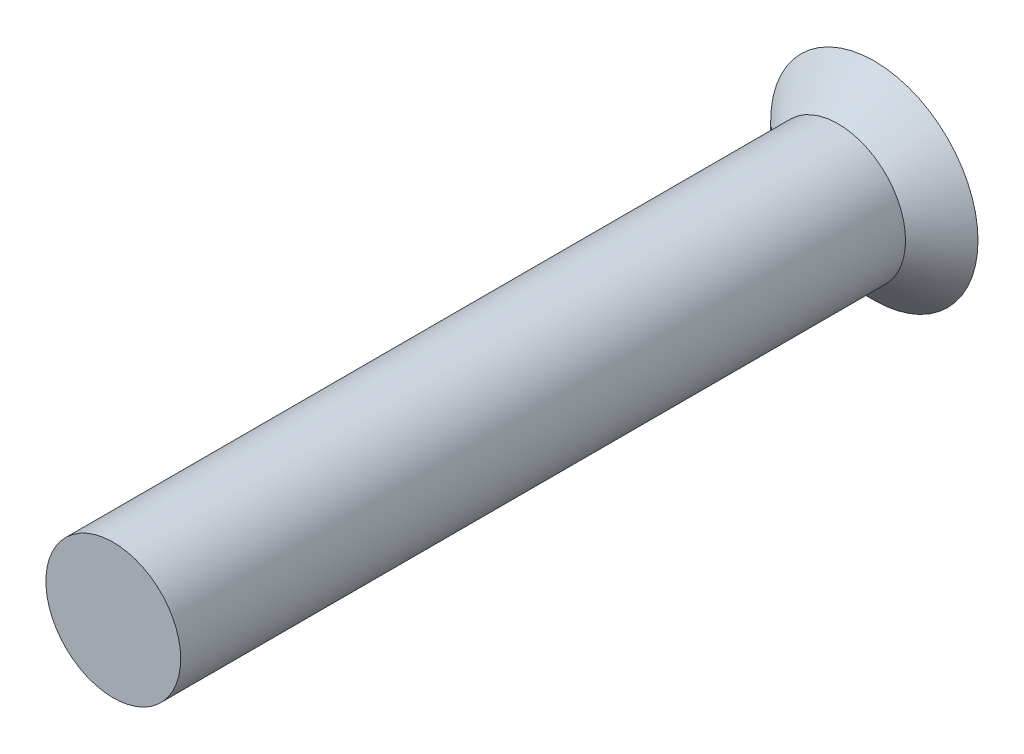
ISO-10303-21;
HEADER;
FILE_DESCRIPTION(('STEP AP214'),'2;1');
FILE_NAME('part.step','',(''),(''),'','','');
FILE_SCHEMA(('AUTOMOTIVE_DESIGN { 1 0 10303 214 1 1 1 1 }'));
ENDSEC;
DATA;
#1=APPLICATION_CONTEXT('core data for automotive mechanical design processes');
#2=APPLICATION_PROTOCOL_DEFINITION('international standard','automotive_design',2000,#1);
#3=PRODUCT_CONTEXT('',#1,'mechanical');
#4=PRODUCT('Part','Part','',(#3));
#5=PRODUCT_RELATED_PRODUCT_CATEGORY('part','',(#4));
#6=PRODUCT_DEFINITION_FORMATION('','',#4);
#7=PRODUCT_DEFINITION_CONTEXT('part definition',#1,'design');
#8=PRODUCT_DEFINITION('design','',#6,#7);
#9=PRODUCT_DEFINITION_SHAPE('','',#8);
#10=(LENGTH_UNIT() NAMED_UNIT(*) SI_UNIT(.MILLI.,.METRE.));
#11=(NAMED_UNIT(*) PLANE_ANGLE_UNIT() SI_UNIT($,.RADIAN.));
#12=(NAMED_UNIT(*) SI_UNIT($,.STERADIAN.) SOLID_ANGLE_UNIT());
#13=UNCERTAINTY_MEASURE_WITH_UNIT(LENGTH_MEASURE(1.E-05),#10,'distance_accuracy_value','');
#14=(GEOMETRIC_REPRESENTATION_CONTEXT(3) GLOBAL_UNCERTAINTY_ASSIGNED_CONTEXT((#13)) GLOBAL_UNIT_ASSIGNED_CONTEXT((#10,
#11,#12)) REPRESENTATION_CONTEXT('',''));
#15=CARTESIAN_POINT('',(0.,0.,0.));
#16=DIRECTION('',(0.,0.,1.));
#17=DIRECTION('',(1.,0.,0.));
#18=AXIS2_PLACEMENT_3D('',#15,#16,#17);
#19=CARTESIAN_POINT('',(0.,0.,2.5));
#20=DIRECTION('',(0.,0.,-1.));
#21=DIRECTION('',(-1.,0.,0.));
#22=AXIS2_PLACEMENT_3D('',#19,#20,#21);
#23=CYLINDRICAL_SURFACE('',#22,0.465);
#24=CARTESIAN_POINT('',(0.,0.,2.5));
#25=DIRECTION('',(0.,0.,1.));
#26=DIRECTION('',(1.,0.,0.));
#27=AXIS2_PLACEMENT_3D('',#24,#25,#26);
#28=CIRCLE('',#27,0.465);
#29=CARTESIAN_POINT('',(0.465,0.,2.5));
#30=VERTEX_POINT('',#29);
#31=EDGE_CURVE('E11',#30,#30,#28,.T.);
#32=ORIENTED_EDGE('',*,*,#31,.F.);
#33=EDGE_LOOP('',(#32));
#34=FACE_BOUND('',#33,.T.);
#35=CARTESIAN_POINT('',(0.,0.,-2.5));
#36=DIRECTION('',(0.,0.,1.));
#37=DIRECTION('',(1.,0.,0.));
#38=AXIS2_PLACEMENT_3D('',#35,#36,#37);
#39=CIRCLE('',#38,0.465);
#40=CARTESIAN_POINT('',(0.465,0.,-2.5));
#41=VERTEX_POINT('',#40);
#42=EDGE_CURVE('E189',#41,#41,#39,.T.);
#43=ORIENTED_EDGE('',*,*,#42,.T.);
#44=EDGE_LOOP('',(#43));
#45=FACE_BOUND('',#44,.T.);
#46=ADVANCED_FACE('F34',(#34,#45),#23,.T.);
#47=CARTESIAN_POINT('',(0.,0.,2.5));
#48=DIRECTION('',(0.,0.,1.));
#49=DIRECTION('',(1.,0.,0.));
#50=AXIS2_PLACEMENT_3D('',#47,#48,#49);
#51=PLANE('',#50);
#52=ORIENTED_EDGE('',*,*,#31,.T.);
#53=EDGE_LOOP('',(#52));
#54=FACE_BOUND('',#53,.T.);
#55=ADVANCED_FACE('F224',(#54),#51,.T.);
#56=CARTESIAN_POINT('',(0.,0.,-2.75));
#57=DIRECTION('',(0.,0.,-1.));
#58=DIRECTION('',(-1.,0.,0.));
#59=AXIS2_PLACEMENT_3D('',#56,#57,#58);
#60=CONICAL_SURFACE('',#59,0.715000000000001,0.785398163397449);
#61=ORIENTED_EDGE('',*,*,#42,.F.);
#62=EDGE_LOOP('',(#61));
#63=FACE_BOUND('',#62,.T.);
#64=CARTESIAN_POINT('',(0.,0.,-2.75));
#65=DIRECTION('',(0.,0.,1.));
#66=DIRECTION('',(1.,0.,0.));
#67=AXIS2_PLACEMENT_3D('',#64,#65,#66);
#68=CIRCLE('',#67,0.715000000000001);
#69=CARTESIAN_POINT('',(0.715000000000001,0.,-2.75));
#70=VERTEX_POINT('',#69);
#71=EDGE_CURVE('E41',#70,#70,#68,.T.);
#72=ORIENTED_EDGE('',*,*,#71,.T.);
#73=EDGE_LOOP('',(#72));
#74=FACE_BOUND('',#73,.T.);
#75=ADVANCED_FACE('F211',(#63,#74),#60,.T.);
#76=CARTESIAN_POINT('',(0.,0.715000000000001,-2.75));
#77=DIRECTION('',(0.,0.,1.));
#78=DIRECTION('',(1.,0.,0.));
#79=AXIS2_PLACEMENT_3D('',#76,#77,#78);
#80=PLANE('',#79);
#81=DIRECTION('',(1.,0.,0.));
#82=VECTOR('',#81,1.);
#83=CARTESIAN_POINT('',(-0.0999999999999999,0.6,-2.75));
#84=LINE('',#83,#82);
#85=CARTESIAN_POINT('',(-0.0999999999999999,0.6,-2.75));
#86=VERTEX_POINT('',#85);
#87=CARTESIAN_POINT('',(0.1,0.6,-2.75));
#88=VERTEX_POINT('',#87);
#89=EDGE_CURVE('E158',#86,#88,#84,.T.);
#90=ORIENTED_EDGE('',*,*,#89,.F.);
#91=DIRECTION('',(0.,1.,0.));
#92=VECTOR('',#91,1.);
#93=CARTESIAN_POINT('',(-0.1,0.1,-2.75));
#94=LINE('',#93,#92);
#95=CARTESIAN_POINT('',(-0.1,0.1,-2.75));
#96=VERTEX_POINT('',#95);
#97=EDGE_CURVE('E48',#96,#86,#94,.T.);
#98=ORIENTED_EDGE('',*,*,#97,.F.);
#99=DIRECTION('',(1.,0.,0.));
#100=VECTOR('',#99,1.);
#101=CARTESIAN_POINT('',(-0.6,0.1,-2.75));
#102=LINE('',#101,#100);
#103=CARTESIAN_POINT('',(-0.6,0.1,-2.75));
#104=VERTEX_POINT('',#103);
#105=EDGE_CURVE('E185',#104,#96,#102,.T.);
#106=ORIENTED_EDGE('',*,*,#105,.F.);
#107=DIRECTION('',(0.,1.,0.));
#108=VECTOR('',#107,1.);
#109=CARTESIAN_POINT('',(-0.6,-0.1,-2.75));
#110=LINE('',#109,#108);
#111=CARTESIAN_POINT('',(-0.6,-0.1,-2.75));
#112=VERTEX_POINT('',#111);
#113=EDGE_CURVE('E183',#112,#104,#110,.T.);
#114=ORIENTED_EDGE('',*,*,#113,.F.);
#115=DIRECTION('',(-1.,0.,0.));
#116=VECTOR('',#115,1.);
#117=CARTESIAN_POINT('',(-0.1,-0.0999999999999998,-2.75));
#118=LINE('',#117,#116);
#119=CARTESIAN_POINT('',(-0.1,-0.0999999999999998,-2.75));
#120=VERTEX_POINT('',#119);
#121=EDGE_CURVE('E132',#120,#112,#118,.T.);
#122=ORIENTED_EDGE('',*,*,#121,.F.);
#123=DIRECTION('',(0.,1.,0.));
#124=VECTOR('',#123,1.);
#125=CARTESIAN_POINT('',(-0.1,-0.6,-2.75));
#126=LINE('',#125,#124);
#127=CARTESIAN_POINT('',(-0.1,-0.6,-2.75));
#128=VERTEX_POINT('',#127);
#129=EDGE_CURVE('E179',#128,#120,#126,.T.);
#130=ORIENTED_EDGE('',*,*,#129,.F.);
#131=DIRECTION('',(-1.,0.,0.));
#132=VECTOR('',#131,1.);
#133=CARTESIAN_POINT('',(0.0999999999999999,-0.6,-2.75));
#134=LINE('',#133,#132);
#135=CARTESIAN_POINT('',(0.0999999999999999,-0.6,-2.75));
#136=VERTEX_POINT('',#135);
#137=EDGE_CURVE('E176',#136,#128,#134,.T.);
#138=ORIENTED_EDGE('',*,*,#137,.F.);
#139=DIRECTION('',(0.,-1.,0.));
#140=VECTOR('',#139,1.);
#141=CARTESIAN_POINT('',(0.1,-0.1,-2.75));
#142=LINE('',#141,#140);
#143=CARTESIAN_POINT('',(0.1,-0.1,-2.75));
#144=VERTEX_POINT('',#143);
#145=EDGE_CURVE('E173',#144,#136,#142,.T.);
#146=ORIENTED_EDGE('',*,*,#145,.F.);
#147=DIRECTION('',(-1.,0.,0.));
#148=VECTOR('',#147,1.);
#149=CARTESIAN_POINT('',(0.6,-0.1,-2.75));
#150=LINE('',#149,#148);
#151=CARTESIAN_POINT('',(0.6,-0.1,-2.75));
#152=VERTEX_POINT('',#151);
#153=EDGE_CURVE('E170',#152,#144,#150,.T.);
#154=ORIENTED_EDGE('',*,*,#153,.F.);
#155=DIRECTION('',(0.,-1.,0.));
#156=VECTOR('',#155,1.);
#157=CARTESIAN_POINT('',(0.6,0.1,-2.75));
#158=LINE('',#157,#156);
#159=CARTESIAN_POINT('',(0.6,0.1,-2.75));
#160=VERTEX_POINT('',#159);
#161=EDGE_CURVE('E167',#160,#152,#158,.T.);
#162=ORIENTED_EDGE('',*,*,#161,.F.);
#163=DIRECTION('',(1.,0.,0.));
#164=VECTOR('',#163,1.);
#165=CARTESIAN_POINT('',(0.0999999999999999,0.1,-2.75));
#166=LINE('',#165,#164);
#167=CARTESIAN_POINT('',(0.0999999999999999,0.1,-2.75));
#168=VERTEX_POINT('',#167);
#169=EDGE_CURVE('E164',#168,#160,#166,.T.);
#170=ORIENTED_EDGE('',*,*,#169,.F.);
#171=DIRECTION('',(0.,-1.,0.));
#172=VECTOR('',#171,1.);
#173=CARTESIAN_POINT('',(0.1,0.6,-2.75));
#174=LINE('',#173,#172);
#175=EDGE_CURVE('E161',#88,#168,#174,.T.);
#176=ORIENTED_EDGE('',*,*,#175,.F.);
#177=EDGE_LOOP('',(#90,#98,#106,#114,#122,#130,#138,#146,#154,#162,#170,#176));
#178=FACE_BOUND('',#177,.T.);
#179=ORIENTED_EDGE('',*,*,#71,.F.);
#180=EDGE_LOOP('',(#179));
#181=FACE_BOUND('',#180,.T.);
#182=ADVANCED_FACE('F213',(#178,#181),#80,.F.);
#183=CARTESIAN_POINT('',(-0.1,0.1,-2.65));
#184=DIRECTION('',(-1.,0.,0.));
#185=DIRECTION('',(0.,-1.,0.));
#186=AXIS2_PLACEMENT_3D('',#183,#184,#185);
#187=PLANE('',#186);
#188=ORIENTED_EDGE('',*,*,#97,.T.);
#189=DIRECTION('',(0.,0.,-1.));
#190=VECTOR('',#189,1.);
#191=CARTESIAN_POINT('',(-0.0999999999999999,0.6,-2.65));
#192=LINE('',#191,#190);
#193=CARTESIAN_POINT('',(-0.0999999999999999,0.6,-2.65));
#194=VERTEX_POINT('',#193);
#195=EDGE_CURVE('E96',#194,#86,#192,.T.);
#196=ORIENTED_EDGE('',*,*,#195,.F.);
#197=DIRECTION('',(0.,1.,0.));
#198=VECTOR('',#197,1.);
#199=CARTESIAN_POINT('',(-0.1,0.1,-2.65));
#200=LINE('',#199,#198);
#201=CARTESIAN_POINT('',(-0.1,0.1,-2.65));
#202=VERTEX_POINT('',#201);
#203=EDGE_CURVE('E187',#202,#194,#200,.T.);
#204=ORIENTED_EDGE('',*,*,#203,.F.);
#205=DIRECTION('',(0.,0.,-1.));
#206=VECTOR('',#205,1.);
#207=CARTESIAN_POINT('',(-0.1,0.1,-2.65));
#208=LINE('',#207,#206);
#209=EDGE_CURVE('E56',#202,#96,#208,.T.);
#210=ORIENTED_EDGE('',*,*,#209,.T.);
#211=EDGE_LOOP('',(#188,#196,#204,#210));
#212=FACE_BOUND('',#211,.T.);
#213=ADVANCED_FACE('F215',(#212),#187,.F.);
#214=CARTESIAN_POINT('',(-0.6,0.1,-2.65));
#215=DIRECTION('',(0.,1.,0.));
#216=DIRECTION('',(-1.,0.,0.));
#217=AXIS2_PLACEMENT_3D('',#214,#215,#216);
#218=PLANE('',#217);
#219=ORIENTED_EDGE('',*,*,#105,.T.);
#220=ORIENTED_EDGE('',*,*,#209,.F.);
#221=DIRECTION('',(1.,0.,0.));
#222=VECTOR('',#221,1.);
#223=CARTESIAN_POINT('',(-0.6,0.1,-2.65));
#224=LINE('',#223,#222);
#225=CARTESIAN_POINT('',(-0.6,0.1,-2.65));
#226=VERTEX_POINT('',#225);
#227=EDGE_CURVE('E144',#226,#202,#224,.T.);
#228=ORIENTED_EDGE('',*,*,#227,.F.);
#229=DIRECTION('',(0.,0.,-1.));
#230=VECTOR('',#229,1.);
#231=CARTESIAN_POINT('',(-0.6,0.1,-2.65));
#232=LINE('',#231,#230);
#233=EDGE_CURVE('E136',#226,#104,#232,.T.);
#234=ORIENTED_EDGE('',*,*,#233,.T.);
#235=EDGE_LOOP('',(#219,#220,#228,#234));
#236=FACE_BOUND('',#235,.T.);
#237=ADVANCED_FACE('F222',(#236),#218,.F.);
#238=CARTESIAN_POINT('',(-0.6,-0.1,-2.65));
#239=DIRECTION('',(-1.,0.,0.));
#240=DIRECTION('',(0.,-1.,0.));
#241=AXIS2_PLACEMENT_3D('',#238,#239,#240);
#242=PLANE('',#241);
#243=ORIENTED_EDGE('',*,*,#113,.T.);
#244=ORIENTED_EDGE('',*,*,#233,.F.);
#245=DIRECTION('',(0.,1.,0.));
#246=VECTOR('',#245,1.);
#247=CARTESIAN_POINT('',(-0.6,-0.1,-2.65));
#248=LINE('',#247,#246);
#249=CARTESIAN_POINT('',(-0.6,-0.1,-2.65));
#250=VERTEX_POINT('',#249);
#251=EDGE_CURVE('E140',#250,#226,#248,.T.);
#252=ORIENTED_EDGE('',*,*,#251,.F.);
#253=DIRECTION('',(0.,0.,-1.));
#254=VECTOR('',#253,1.);
#255=CARTESIAN_POINT('',(-0.6,-0.1,-2.65));
#256=LINE('',#255,#254);
#257=EDGE_CURVE('E125',#250,#112,#256,.T.);
#258=ORIENTED_EDGE('',*,*,#257,.T.);
#259=EDGE_LOOP('',(#243,#244,#252,#258));
#260=FACE_BOUND('',#259,.T.);
#261=ADVANCED_FACE('F141',(#260),#242,.F.);
#262=CARTESIAN_POINT('',(-0.1,-0.0999999999999998,-2.65));
#263=DIRECTION('',(0.,-1.,0.));
#264=DIRECTION('',(1.,0.,0.));
#265=AXIS2_PLACEMENT_3D('',#262,#263,#264);
#266=PLANE('',#265);
#267=ORIENTED_EDGE('',*,*,#121,.T.);
#268=ORIENTED_EDGE('',*,*,#257,.F.);
#269=DIRECTION('',(-1.,0.,0.));
#270=VECTOR('',#269,1.);
#271=CARTESIAN_POINT('',(-0.1,-0.0999999999999998,-2.65));
#272=LINE('',#271,#270);
#273=CARTESIAN_POINT('',(-0.1,-0.0999999999999998,-2.65));
#274=VERTEX_POINT('',#273);
#275=EDGE_CURVE('E129',#274,#250,#272,.T.);
#276=ORIENTED_EDGE('',*,*,#275,.F.);
#277=DIRECTION('',(0.,0.,-1.));
#278=VECTOR('',#277,1.);
#279=CARTESIAN_POINT('',(-0.1,-0.0999999999999998,-2.65));
#280=LINE('',#279,#278);
#281=EDGE_CURVE('E137',#274,#120,#280,.T.);
#282=ORIENTED_EDGE('',*,*,#281,.T.);
#283=EDGE_LOOP('',(#267,#268,#276,#282));
#284=FACE_BOUND('',#283,.T.);
#285=ADVANCED_FACE('F127',(#284),#266,.F.);
#286=CARTESIAN_POINT('',(-0.1,-0.6,-2.65));
#287=DIRECTION('',(-1.,0.,0.));
#288=DIRECTION('',(0.,0.,1.));
#289=AXIS2_PLACEMENT_3D('',#286,#287,#288);
#290=PLANE('',#289);
#291=ORIENTED_EDGE('',*,*,#129,.T.);
#292=ORIENTED_EDGE('',*,*,#281,.F.);
#293=DIRECTION('',(0.,1.,0.));
#294=VECTOR('',#293,1.);
#295=CARTESIAN_POINT('',(-0.1,-0.6,-2.65));
#296=LINE('',#295,#294);
#297=CARTESIAN_POINT('',(-0.1,-0.6,-2.65));
#298=VERTEX_POINT('',#297);
#299=EDGE_CURVE('E150',#298,#274,#296,.T.);
#300=ORIENTED_EDGE('',*,*,#299,.F.);
#301=DIRECTION('',(0.,0.,-1.));
#302=VECTOR('',#301,1.);
#303=CARTESIAN_POINT('',(-0.1,-0.6,-2.65));
#304=LINE('',#303,#302);
#305=EDGE_CURVE('E192',#298,#128,#304,.T.);
#306=ORIENTED_EDGE('',*,*,#305,.T.);
#307=EDGE_LOOP('',(#291,#292,#300,#306));
#308=FACE_BOUND('',#307,.T.);
#309=ADVANCED_FACE('F278',(#308),#290,.F.);
#310=CARTESIAN_POINT('',(0.0999999999999999,-0.6,-2.65));
#311=DIRECTION('',(0.,-1.,0.));
#312=DIRECTION('',(0.,0.,-1.));
#313=AXIS2_PLACEMENT_3D('',#310,#311,#312);
#314=PLANE('',#313);
#315=ORIENTED_EDGE('',*,*,#137,.T.);
#316=ORIENTED_EDGE('',*,*,#305,.F.);
#317=DIRECTION('',(-1.,0.,0.));
#318=VECTOR('',#317,1.);
#319=CARTESIAN_POINT('',(0.0999999999999999,-0.6,-2.65));
#320=LINE('',#319,#318);
#321=CARTESIAN_POINT('',(0.0999999999999999,-0.6,-2.65));
#322=VERTEX_POINT('',#321);
#323=EDGE_CURVE('E152',#322,#298,#320,.T.);
#324=ORIENTED_EDGE('',*,*,#323,.F.);
#325=DIRECTION('',(0.,0.,-1.));
#326=VECTOR('',#325,1.);
#327=CARTESIAN_POINT('',(0.0999999999999999,-0.6,-2.65));
#328=LINE('',#327,#326);
#329=EDGE_CURVE('E194',#322,#136,#328,.T.);
#330=ORIENTED_EDGE('',*,*,#329,.T.);
#331=EDGE_LOOP('',(#315,#316,#324,#330));
#332=FACE_BOUND('',#331,.T.);
#333=ADVANCED_FACE('F287',(#332),#314,.F.);
#334=CARTESIAN_POINT('',(0.1,-0.1,-2.65));
#335=DIRECTION('',(1.,0.,0.));
#336=DIRECTION('',(0.,1.,0.));
#337=AXIS2_PLACEMENT_3D('',#334,#335,#336);
#338=PLANE('',#337);
#339=ORIENTED_EDGE('',*,*,#145,.T.);
#340=ORIENTED_EDGE('',*,*,#329,.F.);
#341=DIRECTION('',(0.,-1.,0.));
#342=VECTOR('',#341,1.);
#343=CARTESIAN_POINT('',(0.1,-0.1,-2.65));
#344=LINE('',#343,#342);
#345=CARTESIAN_POINT('',(0.1,-0.1,-2.65));
#346=VERTEX_POINT('',#345);
#347=EDGE_CURVE('E391',#346,#322,#344,.T.);
#348=ORIENTED_EDGE('',*,*,#347,.F.);
#349=DIRECTION('',(0.,0.,-1.));
#350=VECTOR('',#349,1.);
#351=CARTESIAN_POINT('',(0.1,-0.1,-2.65));
#352=LINE('',#351,#350);
#353=EDGE_CURVE('E196',#346,#144,#352,.T.);
#354=ORIENTED_EDGE('',*,*,#353,.T.);
#355=EDGE_LOOP('',(#339,#340,#348,#354));
#356=FACE_BOUND('',#355,.T.);
#357=ADVANCED_FACE('F297',(#356),#338,.F.);
#358=CARTESIAN_POINT('',(0.6,-0.1,-2.65));
#359=DIRECTION('',(0.,-1.,0.));
#360=DIRECTION('',(0.,0.,-1.));
#361=AXIS2_PLACEMENT_3D('',#358,#359,#360);
#362=PLANE('',#361);
#363=ORIENTED_EDGE('',*,*,#153,.T.);
#364=ORIENTED_EDGE('',*,*,#353,.F.);
#365=DIRECTION('',(-1.,0.,0.));
#366=VECTOR('',#365,1.);
#367=CARTESIAN_POINT('',(0.6,-0.1,-2.65));
#368=LINE('',#367,#366);
#369=CARTESIAN_POINT('',(0.6,-0.1,-2.65));
#370=VERTEX_POINT('',#369);
#371=EDGE_CURVE('E388',#370,#346,#368,.T.);
#372=ORIENTED_EDGE('',*,*,#371,.F.);
#373=DIRECTION('',(0.,0.,-1.));
#374=VECTOR('',#373,1.);
#375=CARTESIAN_POINT('',(0.6,-0.1,-2.65));
#376=LINE('',#375,#374);
#377=EDGE_CURVE('E198',#370,#152,#376,.T.);
#378=ORIENTED_EDGE('',*,*,#377,.T.);
#379=EDGE_LOOP('',(#363,#364,#372,#378));
#380=FACE_BOUND('',#379,.T.);
#381=ADVANCED_FACE('F307',(#380),#362,.F.);
#382=CARTESIAN_POINT('',(0.6,0.1,-2.65));
#383=DIRECTION('',(1.,0.,0.));
#384=DIRECTION('',(0.,1.,0.));
#385=AXIS2_PLACEMENT_3D('',#382,#383,#384);
#386=PLANE('',#385);
#387=ORIENTED_EDGE('',*,*,#161,.T.);
#388=ORIENTED_EDGE('',*,*,#377,.F.);
#389=DIRECTION('',(0.,-1.,0.));
#390=VECTOR('',#389,1.);
#391=CARTESIAN_POINT('',(0.6,0.1,-2.65));
#392=LINE('',#391,#390);
#393=CARTESIAN_POINT('',(0.6,0.1,-2.65));
#394=VERTEX_POINT('',#393);
#395=EDGE_CURVE('E385',#394,#370,#392,.T.);
#396=ORIENTED_EDGE('',*,*,#395,.F.);
#397=DIRECTION('',(0.,0.,-1.));
#398=VECTOR('',#397,1.);
#399=CARTESIAN_POINT('',(0.6,0.1,-2.65));
#400=LINE('',#399,#398);
#401=EDGE_CURVE('E200',#394,#160,#400,.T.);
#402=ORIENTED_EDGE('',*,*,#401,.T.);
#403=EDGE_LOOP('',(#387,#388,#396,#402));
#404=FACE_BOUND('',#403,.T.);
#405=ADVANCED_FACE('F317',(#404),#386,.F.);
#406=CARTESIAN_POINT('',(0.0999999999999999,0.1,-2.65));
#407=DIRECTION('',(0.,1.,0.));
#408=DIRECTION('',(0.,0.,1.));
#409=AXIS2_PLACEMENT_3D('',#406,#407,#408);
#410=PLANE('',#409);
#411=ORIENTED_EDGE('',*,*,#169,.T.);
#412=ORIENTED_EDGE('',*,*,#401,.F.);
#413=DIRECTION('',(1.,0.,0.));
#414=VECTOR('',#413,1.);
#415=CARTESIAN_POINT('',(0.0999999999999999,0.1,-2.65));
#416=LINE('',#415,#414);
#417=CARTESIAN_POINT('',(0.0999999999999999,0.1,-2.65));
#418=VERTEX_POINT('',#417);
#419=EDGE_CURVE('E378',#418,#394,#416,.T.);
#420=ORIENTED_EDGE('',*,*,#419,.F.);
#421=DIRECTION('',(0.,0.,-1.));
#422=VECTOR('',#421,1.);
#423=CARTESIAN_POINT('',(0.0999999999999999,0.1,-2.65));
#424=LINE('',#423,#422);
#425=EDGE_CURVE('E202',#418,#168,#424,.T.);
#426=ORIENTED_EDGE('',*,*,#425,.T.);
#427=EDGE_LOOP('',(#411,#412,#420,#426));
#428=FACE_BOUND('',#427,.T.);
#429=ADVANCED_FACE('F327',(#428),#410,.F.);
#430=CARTESIAN_POINT('',(0.1,0.6,-2.65));
#431=DIRECTION('',(1.,0.,0.));
#432=DIRECTION('',(0.,1.,0.));
#433=AXIS2_PLACEMENT_3D('',#430,#431,#432);
#434=PLANE('',#433);
#435=ORIENTED_EDGE('',*,*,#175,.T.);
#436=ORIENTED_EDGE('',*,*,#425,.F.);
#437=DIRECTION('',(0.,-1.,0.));
#438=VECTOR('',#437,1.);
#439=CARTESIAN_POINT('',(0.1,0.6,-2.65));
#440=LINE('',#439,#438);
#441=CARTESIAN_POINT('',(0.1,0.6,-2.65));
#442=VERTEX_POINT('',#441);
#443=EDGE_CURVE('E375',#442,#418,#440,.T.);
#444=ORIENTED_EDGE('',*,*,#443,.F.);
#445=DIRECTION('',(0.,0.,-1.));
#446=VECTOR('',#445,1.);
#447=CARTESIAN_POINT('',(0.1,0.6,-2.65));
#448=LINE('',#447,#446);
#449=EDGE_CURVE('E204',#442,#88,#448,.T.);
#450=ORIENTED_EDGE('',*,*,#449,.T.);
#451=EDGE_LOOP('',(#435,#436,#444,#450));
#452=FACE_BOUND('',#451,.T.);
#453=ADVANCED_FACE('F337',(#452),#434,.F.);
#454=CARTESIAN_POINT('',(-0.0999999999999999,0.6,-2.65));
#455=DIRECTION('',(0.,1.,0.));
#456=DIRECTION('',(-1.,0.,0.));
#457=AXIS2_PLACEMENT_3D('',#454,#455,#456);
#458=PLANE('',#457);
#459=ORIENTED_EDGE('',*,*,#89,.T.);
#460=ORIENTED_EDGE('',*,*,#449,.F.);
#461=DIRECTION('',(1.,0.,0.));
#462=VECTOR('',#461,1.);
#463=CARTESIAN_POINT('',(-0.0999999999999999,0.6,-2.65));
#464=LINE('',#463,#462);
#465=EDGE_CURVE('E379',#194,#442,#464,.T.);
#466=ORIENTED_EDGE('',*,*,#465,.F.);
#467=ORIENTED_EDGE('',*,*,#195,.T.);
#468=EDGE_LOOP('',(#459,#460,#466,#467));
#469=FACE_BOUND('',#468,.T.);
#470=ADVANCED_FACE('F347',(#469),#458,.F.);
#471=CARTESIAN_POINT('',(0.,0.,-2.65));
#472=DIRECTION('',(0.,0.,-1.));
#473=DIRECTION('',(-1.,0.,0.));
#474=AXIS2_PLACEMENT_3D('',#471,#472,#473);
#475=PLANE('',#474);
#476=ORIENTED_EDGE('',*,*,#203,.T.);
#477=ORIENTED_EDGE('',*,*,#465,.T.);
#478=ORIENTED_EDGE('',*,*,#443,.T.);
#479=ORIENTED_EDGE('',*,*,#419,.T.);
#480=ORIENTED_EDGE('',*,*,#395,.T.);
#481=ORIENTED_EDGE('',*,*,#371,.T.);
#482=ORIENTED_EDGE('',*,*,#347,.T.);
#483=ORIENTED_EDGE('',*,*,#323,.T.);
#484=ORIENTED_EDGE('',*,*,#299,.T.);
#485=ORIENTED_EDGE('',*,*,#275,.T.);
#486=ORIENTED_EDGE('',*,*,#251,.T.);
#487=ORIENTED_EDGE('',*,*,#227,.T.);
#488=EDGE_LOOP('',(#476,#477,#478,#479,#480,#481,#482,#483,#484,#485,#486,#487));
#489=FACE_BOUND('',#488,.T.);
#490=ADVANCED_FACE('F147',(#489),#475,.T.);
#491=CLOSED_SHELL('',(#46,#55,#75,#182,#213,#237,#261,#285,#309,#333,#357,#381,#405,#429,#453,
#470,#490));
#492=MANIFOLD_SOLID_BREP('B2',#491);
#493=ADVANCED_BREP_SHAPE_REPRESENTATION('',(#18,#492),#14);
#494=SHAPE_DEFINITION_REPRESENTATION(#9,#493);
ENDSEC;
END-ISO-10303-21;
